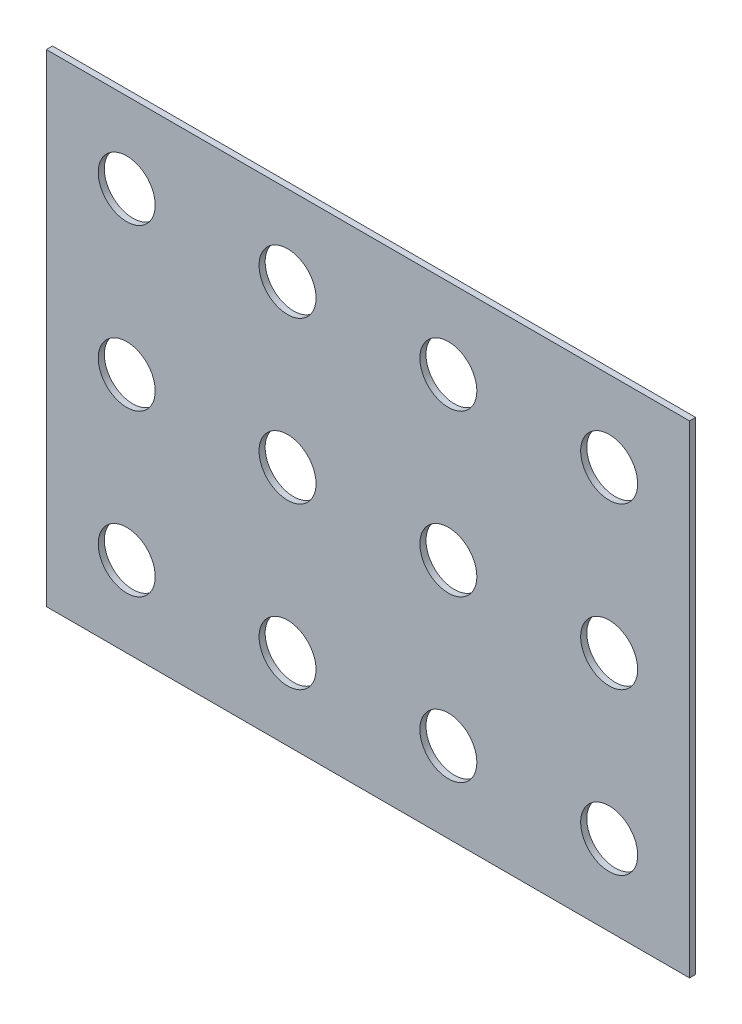
ISO-10303-21;
HEADER;
FILE_DESCRIPTION(('STEP AP214'),'2;1');
FILE_NAME('part.step','',(''),(''),'','','');
FILE_SCHEMA(('AUTOMOTIVE_DESIGN { 1 0 10303 214 1 1 1 1 }'));
ENDSEC;
DATA;
#1=APPLICATION_CONTEXT('core data for automotive mechanical design processes');
#2=APPLICATION_PROTOCOL_DEFINITION('international standard','automotive_design',2000,#1);
#3=PRODUCT_CONTEXT('',#1,'mechanical');
#4=PRODUCT('Part','Part','',(#3));
#5=PRODUCT_RELATED_PRODUCT_CATEGORY('part','',(#4));
#6=PRODUCT_DEFINITION_FORMATION('','',#4);
#7=PRODUCT_DEFINITION_CONTEXT('part definition',#1,'design');
#8=PRODUCT_DEFINITION('design','',#6,#7);
#9=PRODUCT_DEFINITION_SHAPE('','',#8);
#10=(LENGTH_UNIT() NAMED_UNIT(*) SI_UNIT(.MILLI.,.METRE.));
#11=(NAMED_UNIT(*) PLANE_ANGLE_UNIT() SI_UNIT($,.RADIAN.));
#12=(NAMED_UNIT(*) SI_UNIT($,.STERADIAN.) SOLID_ANGLE_UNIT());
#13=UNCERTAINTY_MEASURE_WITH_UNIT(LENGTH_MEASURE(1.E-05),#10,'distance_accuracy_value','');
#14=(GEOMETRIC_REPRESENTATION_CONTEXT(3) GLOBAL_UNCERTAINTY_ASSIGNED_CONTEXT((#13)) GLOBAL_UNIT_ASSIGNED_CONTEXT((#10,
#11,#12)) REPRESENTATION_CONTEXT('',''));
#15=CARTESIAN_POINT('',(0.,0.,0.));
#16=DIRECTION('',(0.,0.,1.));
#17=DIRECTION('',(1.,0.,0.));
#18=AXIS2_PLACEMENT_3D('',#15,#16,#17);
#19=CARTESIAN_POINT('',(0.,0.,0.09652));
#20=DIRECTION('',(0.,0.,1.));
#21=DIRECTION('',(1.,0.,0.));
#22=AXIS2_PLACEMENT_3D('',#19,#20,#21);
#23=PLANE('',#22);
#24=CARTESIAN_POINT('',(8.89,6.35,0.09652));
#25=DIRECTION('',(0.,0.,1.));
#26=DIRECTION('',(1.,0.,0.));
#27=AXIS2_PLACEMENT_3D('',#24,#25,#26);
#28=CIRCLE('',#27,0.4499991);
#29=CARTESIAN_POINT('',(9.3399991,6.35,0.09652));
#30=VERTEX_POINT('',#29);
#31=EDGE_CURVE('E27',#30,#30,#28,.T.);
#32=ORIENTED_EDGE('',*,*,#31,.F.);
#33=EDGE_LOOP('',(#32));
#34=FACE_BOUND('',#33,.T.);
#35=CARTESIAN_POINT('',(8.89,3.81,0.09652));
#36=DIRECTION('',(0.,0.,1.));
#37=DIRECTION('',(1.,0.,0.));
#38=AXIS2_PLACEMENT_3D('',#35,#36,#37);
#39=CIRCLE('',#38,0.4499991);
#40=CARTESIAN_POINT('',(9.3399991,3.81,0.09652));
#41=VERTEX_POINT('',#40);
#42=EDGE_CURVE('E238',#41,#41,#39,.T.);
#43=ORIENTED_EDGE('',*,*,#42,.F.);
#44=EDGE_LOOP('',(#43));
#45=FACE_BOUND('',#44,.T.);
#46=CARTESIAN_POINT('',(6.35,6.35,0.09652));
#47=DIRECTION('',(0.,0.,1.));
#48=DIRECTION('',(1.,0.,0.));
#49=AXIS2_PLACEMENT_3D('',#46,#47,#48);
#50=CIRCLE('',#49,0.4499991);
#51=CARTESIAN_POINT('',(6.7999991,6.35,0.09652));
#52=VERTEX_POINT('',#51);
#53=EDGE_CURVE('E102',#52,#52,#50,.T.);
#54=ORIENTED_EDGE('',*,*,#53,.F.);
#55=EDGE_LOOP('',(#54));
#56=FACE_BOUND('',#55,.T.);
#57=CARTESIAN_POINT('',(6.35,1.27,0.09652));
#58=DIRECTION('',(0.,0.,1.));
#59=DIRECTION('',(1.,0.,0.));
#60=AXIS2_PLACEMENT_3D('',#57,#58,#59);
#61=CIRCLE('',#60,0.4499991);
#62=CARTESIAN_POINT('',(6.7999991,1.27,0.09652));
#63=VERTEX_POINT('',#62);
#64=EDGE_CURVE('E230',#63,#63,#61,.T.);
#65=ORIENTED_EDGE('',*,*,#64,.F.);
#66=EDGE_LOOP('',(#65));
#67=FACE_BOUND('',#66,.T.);
#68=CARTESIAN_POINT('',(8.89,1.27,0.09652));
#69=DIRECTION('',(0.,0.,1.));
#70=DIRECTION('',(1.,0.,0.));
#71=AXIS2_PLACEMENT_3D('',#68,#69,#70);
#72=CIRCLE('',#71,0.4499991);
#73=CARTESIAN_POINT('',(9.3399991,1.27,0.09652));
#74=VERTEX_POINT('',#73);
#75=EDGE_CURVE('E332',#74,#74,#72,.T.);
#76=ORIENTED_EDGE('',*,*,#75,.F.);
#77=EDGE_LOOP('',(#76));
#78=FACE_BOUND('',#77,.T.);
#79=CARTESIAN_POINT('',(6.35,3.81,0.09652));
#80=DIRECTION('',(0.,0.,1.));
#81=DIRECTION('',(1.,0.,0.));
#82=AXIS2_PLACEMENT_3D('',#79,#80,#81);
#83=CIRCLE('',#82,0.4499991);
#84=CARTESIAN_POINT('',(6.7999991,3.81,0.09652));
#85=VERTEX_POINT('',#84);
#86=EDGE_CURVE('E260',#85,#85,#83,.T.);
#87=ORIENTED_EDGE('',*,*,#86,.F.);
#88=EDGE_LOOP('',(#87));
#89=FACE_BOUND('',#88,.T.);
#90=CARTESIAN_POINT('',(3.81,6.35,0.09652));
#91=DIRECTION('',(0.,0.,1.));
#92=DIRECTION('',(1.,0.,0.));
#93=AXIS2_PLACEMENT_3D('',#90,#91,#92);
#94=CIRCLE('',#93,0.4499991);
#95=CARTESIAN_POINT('',(4.2599991,6.35,0.09652));
#96=VERTEX_POINT('',#95);
#97=EDGE_CURVE('E225',#96,#96,#94,.T.);
#98=ORIENTED_EDGE('',*,*,#97,.F.);
#99=EDGE_LOOP('',(#98));
#100=FACE_BOUND('',#99,.T.);
#101=CARTESIAN_POINT('',(3.81,3.81,0.09652));
#102=DIRECTION('',(0.,0.,1.));
#103=DIRECTION('',(1.,0.,0.));
#104=AXIS2_PLACEMENT_3D('',#101,#102,#103);
#105=CIRCLE('',#104,0.4499991);
#106=CARTESIAN_POINT('',(4.2599991,3.81,0.09652));
#107=VERTEX_POINT('',#106);
#108=EDGE_CURVE('E216',#107,#107,#105,.T.);
#109=ORIENTED_EDGE('',*,*,#108,.F.);
#110=EDGE_LOOP('',(#109));
#111=FACE_BOUND('',#110,.T.);
#112=CARTESIAN_POINT('',(1.27,6.35,0.09652));
#113=DIRECTION('',(0.,0.,1.));
#114=DIRECTION('',(1.,0.,0.));
#115=AXIS2_PLACEMENT_3D('',#112,#113,#114);
#116=CIRCLE('',#115,0.4499991);
#117=CARTESIAN_POINT('',(1.7199991,6.35,0.09652));
#118=VERTEX_POINT('',#117);
#119=EDGE_CURVE('E273',#118,#118,#116,.T.);
#120=ORIENTED_EDGE('',*,*,#119,.F.);
#121=EDGE_LOOP('',(#120));
#122=FACE_BOUND('',#121,.T.);
#123=CARTESIAN_POINT('',(1.27,1.27,0.09652));
#124=DIRECTION('',(0.,0.,1.));
#125=DIRECTION('',(1.,0.,0.));
#126=AXIS2_PLACEMENT_3D('',#123,#124,#125);
#127=CIRCLE('',#126,0.4499991);
#128=CARTESIAN_POINT('',(1.7199991,1.27,0.09652));
#129=VERTEX_POINT('',#128);
#130=EDGE_CURVE('E291',#129,#129,#127,.T.);
#131=ORIENTED_EDGE('',*,*,#130,.F.);
#132=EDGE_LOOP('',(#131));
#133=FACE_BOUND('',#132,.T.);
#134=CARTESIAN_POINT('',(3.81,1.27,0.09652));
#135=DIRECTION('',(0.,0.,1.));
#136=DIRECTION('',(1.,0.,0.));
#137=AXIS2_PLACEMENT_3D('',#134,#135,#136);
#138=CIRCLE('',#137,0.4499991);
#139=CARTESIAN_POINT('',(4.2599991,1.27,0.09652));
#140=VERTEX_POINT('',#139);
#141=EDGE_CURVE('E217',#140,#140,#138,.T.);
#142=ORIENTED_EDGE('',*,*,#141,.F.);
#143=EDGE_LOOP('',(#142));
#144=FACE_BOUND('',#143,.T.);
#145=CARTESIAN_POINT('',(1.27,3.81,0.09652));
#146=DIRECTION('',(0.,0.,1.));
#147=DIRECTION('',(1.,0.,0.));
#148=AXIS2_PLACEMENT_3D('',#145,#146,#147);
#149=CIRCLE('',#148,0.4499991);
#150=CARTESIAN_POINT('',(1.7199991,3.81,0.09652));
#151=VERTEX_POINT('',#150);
#152=EDGE_CURVE('E233',#151,#151,#149,.T.);
#153=ORIENTED_EDGE('',*,*,#152,.F.);
#154=EDGE_LOOP('',(#153));
#155=FACE_BOUND('',#154,.T.);
#156=DIRECTION('',(-1.,0.,0.));
#157=VECTOR('',#156,1.);
#158=CARTESIAN_POINT('',(10.159999847412,0.,0.09652));
#159=LINE('',#158,#157);
#160=CARTESIAN_POINT('',(10.159999847412,0.,0.09652));
#161=VERTEX_POINT('',#160);
#162=CARTESIAN_POINT('',(0.,0.,0.09652));
#163=VERTEX_POINT('',#162);
#164=EDGE_CURVE('E176',#161,#163,#159,.T.);
#165=ORIENTED_EDGE('',*,*,#164,.F.);
#166=DIRECTION('',(0.,-1.,0.));
#167=VECTOR('',#166,1.);
#168=CARTESIAN_POINT('',(10.159999847412,7.619999885559,0.09652));
#169=LINE('',#168,#167);
#170=CARTESIAN_POINT('',(10.159999847412,7.619999885559,0.09652));
#171=VERTEX_POINT('',#170);
#172=EDGE_CURVE('E209',#171,#161,#169,.T.);
#173=ORIENTED_EDGE('',*,*,#172,.F.);
#174=DIRECTION('',(1.,0.,0.));
#175=VECTOR('',#174,1.);
#176=CARTESIAN_POINT('',(0.,7.619999885559,0.09652));
#177=LINE('',#176,#175);
#178=CARTESIAN_POINT('',(0.,7.619999885559,0.09652));
#179=VERTEX_POINT('',#178);
#180=EDGE_CURVE('E191',#179,#171,#177,.T.);
#181=ORIENTED_EDGE('',*,*,#180,.F.);
#182=DIRECTION('',(0.,1.,0.));
#183=VECTOR('',#182,1.);
#184=CARTESIAN_POINT('',(0.,0.,0.09652));
#185=LINE('',#184,#183);
#186=EDGE_CURVE('E189',#163,#179,#185,.T.);
#187=ORIENTED_EDGE('',*,*,#186,.F.);
#188=EDGE_LOOP('',(#165,#173,#181,#187));
#189=FACE_BOUND('',#188,.T.);
#190=ADVANCED_FACE('F16',(#34,#45,#56,#67,#78,#89,#100,#111,#122,#133,#144,#155,#189),#23,.T.);
#191=CARTESIAN_POINT('',(0.,0.,0.));
#192=DIRECTION('',(0.,0.,1.));
#193=DIRECTION('',(1.,0.,0.));
#194=AXIS2_PLACEMENT_3D('',#191,#192,#193);
#195=PLANE('',#194);
#196=CARTESIAN_POINT('',(8.89,6.35,0.));
#197=DIRECTION('',(0.,0.,1.));
#198=DIRECTION('',(1.,0.,0.));
#199=AXIS2_PLACEMENT_3D('',#196,#197,#198);
#200=CIRCLE('',#199,0.4499991);
#201=CARTESIAN_POINT('',(9.3399991,6.35,0.));
#202=VERTEX_POINT('',#201);
#203=EDGE_CURVE('E11',#202,#202,#200,.T.);
#204=ORIENTED_EDGE('',*,*,#203,.T.);
#205=EDGE_LOOP('',(#204));
#206=FACE_BOUND('',#205,.T.);
#207=CARTESIAN_POINT('',(8.89,3.81,0.));
#208=DIRECTION('',(0.,0.,1.));
#209=DIRECTION('',(1.,0.,0.));
#210=AXIS2_PLACEMENT_3D('',#207,#208,#209);
#211=CIRCLE('',#210,0.4499991);
#212=CARTESIAN_POINT('',(9.3399991,3.81,0.));
#213=VERTEX_POINT('',#212);
#214=EDGE_CURVE('E241',#213,#213,#211,.T.);
#215=ORIENTED_EDGE('',*,*,#214,.T.);
#216=EDGE_LOOP('',(#215));
#217=FACE_BOUND('',#216,.T.);
#218=CARTESIAN_POINT('',(6.35,6.35,0.));
#219=DIRECTION('',(0.,0.,1.));
#220=DIRECTION('',(1.,0.,0.));
#221=AXIS2_PLACEMENT_3D('',#218,#219,#220);
#222=CIRCLE('',#221,0.4499991);
#223=CARTESIAN_POINT('',(6.7999991,6.35,0.));
#224=VERTEX_POINT('',#223);
#225=EDGE_CURVE('E91',#224,#224,#222,.T.);
#226=ORIENTED_EDGE('',*,*,#225,.T.);
#227=EDGE_LOOP('',(#226));
#228=FACE_BOUND('',#227,.T.);
#229=CARTESIAN_POINT('',(6.35,1.27,0.));
#230=DIRECTION('',(0.,0.,1.));
#231=DIRECTION('',(1.,0.,0.));
#232=AXIS2_PLACEMENT_3D('',#229,#230,#231);
#233=CIRCLE('',#232,0.4499991);
#234=CARTESIAN_POINT('',(6.7999991,1.27,0.));
#235=VERTEX_POINT('',#234);
#236=EDGE_CURVE('E226',#235,#235,#233,.T.);
#237=ORIENTED_EDGE('',*,*,#236,.T.);
#238=EDGE_LOOP('',(#237));
#239=FACE_BOUND('',#238,.T.);
#240=CARTESIAN_POINT('',(8.89,1.27,0.));
#241=DIRECTION('',(0.,0.,1.));
#242=DIRECTION('',(1.,0.,0.));
#243=AXIS2_PLACEMENT_3D('',#240,#241,#242);
#244=CIRCLE('',#243,0.4499991);
#245=CARTESIAN_POINT('',(9.3399991,1.27,0.));
#246=VERTEX_POINT('',#245);
#247=EDGE_CURVE('E267',#246,#246,#244,.T.);
#248=ORIENTED_EDGE('',*,*,#247,.T.);
#249=EDGE_LOOP('',(#248));
#250=FACE_BOUND('',#249,.T.);
#251=CARTESIAN_POINT('',(6.35,3.81,0.));
#252=DIRECTION('',(0.,0.,1.));
#253=DIRECTION('',(1.,0.,0.));
#254=AXIS2_PLACEMENT_3D('',#251,#252,#253);
#255=CIRCLE('',#254,0.4499991);
#256=CARTESIAN_POINT('',(6.7999991,3.81,0.));
#257=VERTEX_POINT('',#256);
#258=EDGE_CURVE('E256',#257,#257,#255,.T.);
#259=ORIENTED_EDGE('',*,*,#258,.T.);
#260=EDGE_LOOP('',(#259));
#261=FACE_BOUND('',#260,.T.);
#262=CARTESIAN_POINT('',(3.81,6.35,0.));
#263=DIRECTION('',(0.,0.,1.));
#264=DIRECTION('',(1.,0.,0.));
#265=AXIS2_PLACEMENT_3D('',#262,#263,#264);
#266=CIRCLE('',#265,0.4499991);
#267=CARTESIAN_POINT('',(4.2599991,6.35,0.));
#268=VERTEX_POINT('',#267);
#269=EDGE_CURVE('E255',#268,#268,#266,.T.);
#270=ORIENTED_EDGE('',*,*,#269,.T.);
#271=EDGE_LOOP('',(#270));
#272=FACE_BOUND('',#271,.T.);
#273=CARTESIAN_POINT('',(3.81,3.81,0.));
#274=DIRECTION('',(0.,0.,1.));
#275=DIRECTION('',(1.,0.,0.));
#276=AXIS2_PLACEMENT_3D('',#273,#274,#275);
#277=CIRCLE('',#276,0.4499991);
#278=CARTESIAN_POINT('',(4.2599991,3.81,0.));
#279=VERTEX_POINT('',#278);
#280=EDGE_CURVE('E212',#279,#279,#277,.T.);
#281=ORIENTED_EDGE('',*,*,#280,.T.);
#282=EDGE_LOOP('',(#281));
#283=FACE_BOUND('',#282,.T.);
#284=CARTESIAN_POINT('',(1.27,6.35,0.));
#285=DIRECTION('',(0.,0.,1.));
#286=DIRECTION('',(1.,0.,0.));
#287=AXIS2_PLACEMENT_3D('',#284,#285,#286);
#288=CIRCLE('',#287,0.4499991);
#289=CARTESIAN_POINT('',(1.7199991,6.35,0.));
#290=VERTEX_POINT('',#289);
#291=EDGE_CURVE('E270',#290,#290,#288,.T.);
#292=ORIENTED_EDGE('',*,*,#291,.T.);
#293=EDGE_LOOP('',(#292));
#294=FACE_BOUND('',#293,.T.);
#295=CARTESIAN_POINT('',(1.27,1.27,0.));
#296=DIRECTION('',(0.,0.,1.));
#297=DIRECTION('',(1.,0.,0.));
#298=AXIS2_PLACEMENT_3D('',#295,#296,#297);
#299=CIRCLE('',#298,0.4499991);
#300=CARTESIAN_POINT('',(1.7199991,1.27,0.));
#301=VERTEX_POINT('',#300);
#302=EDGE_CURVE('E20',#301,#301,#299,.T.);
#303=ORIENTED_EDGE('',*,*,#302,.T.);
#304=EDGE_LOOP('',(#303));
#305=FACE_BOUND('',#304,.T.);
#306=CARTESIAN_POINT('',(3.81,1.27,0.));
#307=DIRECTION('',(0.,0.,1.));
#308=DIRECTION('',(1.,0.,0.));
#309=AXIS2_PLACEMENT_3D('',#306,#307,#308);
#310=CIRCLE('',#309,0.4499991);
#311=CARTESIAN_POINT('',(4.2599991,1.27,0.));
#312=VERTEX_POINT('',#311);
#313=EDGE_CURVE('E221',#312,#312,#310,.T.);
#314=ORIENTED_EDGE('',*,*,#313,.T.);
#315=EDGE_LOOP('',(#314));
#316=FACE_BOUND('',#315,.T.);
#317=CARTESIAN_POINT('',(1.27,3.81,0.));
#318=DIRECTION('',(0.,0.,1.));
#319=DIRECTION('',(1.,0.,0.));
#320=AXIS2_PLACEMENT_3D('',#317,#318,#319);
#321=CIRCLE('',#320,0.4499991);
#322=CARTESIAN_POINT('',(1.7199991,3.81,0.));
#323=VERTEX_POINT('',#322);
#324=EDGE_CURVE('E236',#323,#323,#321,.T.);
#325=ORIENTED_EDGE('',*,*,#324,.T.);
#326=EDGE_LOOP('',(#325));
#327=FACE_BOUND('',#326,.T.);
#328=DIRECTION('',(0.,1.,0.));
#329=VECTOR('',#328,1.);
#330=CARTESIAN_POINT('',(0.,0.,0.));
#331=LINE('',#330,#329);
#332=CARTESIAN_POINT('',(0.,0.,0.));
#333=VERTEX_POINT('',#332);
#334=CARTESIAN_POINT('',(0.,7.619999885559,0.));
#335=VERTEX_POINT('',#334);
#336=EDGE_CURVE('E199',#333,#335,#331,.T.);
#337=ORIENTED_EDGE('',*,*,#336,.T.);
#338=DIRECTION('',(1.,0.,0.));
#339=VECTOR('',#338,1.);
#340=CARTESIAN_POINT('',(0.,7.619999885559,0.));
#341=LINE('',#340,#339);
#342=CARTESIAN_POINT('',(10.159999847412,7.619999885559,0.));
#343=VERTEX_POINT('',#342);
#344=EDGE_CURVE('E211',#335,#343,#341,.T.);
#345=ORIENTED_EDGE('',*,*,#344,.T.);
#346=DIRECTION('',(0.,-1.,0.));
#347=VECTOR('',#346,1.);
#348=CARTESIAN_POINT('',(10.159999847412,7.619999885559,0.));
#349=LINE('',#348,#347);
#350=CARTESIAN_POINT('',(10.159999847412,0.,0.));
#351=VERTEX_POINT('',#350);
#352=EDGE_CURVE('E186',#343,#351,#349,.T.);
#353=ORIENTED_EDGE('',*,*,#352,.T.);
#354=DIRECTION('',(-1.,0.,0.));
#355=VECTOR('',#354,1.);
#356=CARTESIAN_POINT('',(10.159999847412,0.,0.));
#357=LINE('',#356,#355);
#358=EDGE_CURVE('E167',#351,#333,#357,.T.);
#359=ORIENTED_EDGE('',*,*,#358,.T.);
#360=EDGE_LOOP('',(#337,#345,#353,#359));
#361=FACE_BOUND('',#360,.T.);
#362=ADVANCED_FACE('F313',(#206,#217,#228,#239,#250,#261,#272,#283,#294,#305,#316,#327,#361),
#195,.F.);
#363=CARTESIAN_POINT('',(8.89,6.35,0.));
#364=DIRECTION('',(0.,0.,-1.));
#365=DIRECTION('',(1.,0.,0.));
#366=AXIS2_PLACEMENT_3D('',#363,#364,#365);
#367=CYLINDRICAL_SURFACE('',#366,0.4499991);
#368=DIRECTION('',(0.,0.,1.));
#369=VECTOR('',#368,1.);
#370=CARTESIAN_POINT('',(9.3399991,6.35,0.));
#371=LINE('',#370,#369);
#372=EDGE_CURVE('E243',#202,#30,#371,.T.);
#373=ORIENTED_EDGE('',*,*,#372,.T.);
#374=ORIENTED_EDGE('',*,*,#31,.T.);
#375=ORIENTED_EDGE('',*,*,#372,.F.);
#376=ORIENTED_EDGE('',*,*,#203,.F.);
#377=EDGE_LOOP('',(#373,#374,#375,#376));
#378=FACE_BOUND('',#377,.T.);
#379=ADVANCED_FACE('F393',(#378),#367,.F.);
#380=CARTESIAN_POINT('',(8.89,3.81,0.));
#381=DIRECTION('',(0.,0.,-1.));
#382=DIRECTION('',(1.,0.,0.));
#383=AXIS2_PLACEMENT_3D('',#380,#381,#382);
#384=CYLINDRICAL_SURFACE('',#383,0.4499991);
#385=DIRECTION('',(0.,0.,1.));
#386=VECTOR('',#385,1.);
#387=CARTESIAN_POINT('',(9.3399991,3.81,0.));
#388=LINE('',#387,#386);
#389=EDGE_CURVE('E242',#213,#41,#388,.T.);
#390=ORIENTED_EDGE('',*,*,#389,.T.);
#391=ORIENTED_EDGE('',*,*,#42,.T.);
#392=ORIENTED_EDGE('',*,*,#389,.F.);
#393=ORIENTED_EDGE('',*,*,#214,.F.);
#394=EDGE_LOOP('',(#390,#391,#392,#393));
#395=FACE_BOUND('',#394,.T.);
#396=ADVANCED_FACE('F399',(#395),#384,.F.);
#397=CARTESIAN_POINT('',(6.35,6.35,0.));
#398=DIRECTION('',(0.,0.,-1.));
#399=DIRECTION('',(1.,0.,0.));
#400=AXIS2_PLACEMENT_3D('',#397,#398,#399);
#401=CYLINDRICAL_SURFACE('',#400,0.4499991);
#402=DIRECTION('',(0.,0.,1.));
#403=VECTOR('',#402,1.);
#404=CARTESIAN_POINT('',(6.7999991,6.35,0.));
#405=LINE('',#404,#403);
#406=EDGE_CURVE('E229',#224,#52,#405,.T.);
#407=ORIENTED_EDGE('',*,*,#406,.T.);
#408=ORIENTED_EDGE('',*,*,#53,.T.);
#409=ORIENTED_EDGE('',*,*,#406,.F.);
#410=ORIENTED_EDGE('',*,*,#225,.F.);
#411=EDGE_LOOP('',(#407,#408,#409,#410));
#412=FACE_BOUND('',#411,.T.);
#413=ADVANCED_FACE('F18',(#412),#401,.F.);
#414=CARTESIAN_POINT('',(6.35,1.27,0.));
#415=DIRECTION('',(0.,0.,-1.));
#416=DIRECTION('',(1.,0.,0.));
#417=AXIS2_PLACEMENT_3D('',#414,#415,#416);
#418=CYLINDRICAL_SURFACE('',#417,0.4499991);
#419=DIRECTION('',(0.,0.,1.));
#420=VECTOR('',#419,1.);
#421=CARTESIAN_POINT('',(6.7999991,1.27,0.));
#422=LINE('',#421,#420);
#423=EDGE_CURVE('E263',#235,#63,#422,.T.);
#424=ORIENTED_EDGE('',*,*,#423,.T.);
#425=ORIENTED_EDGE('',*,*,#64,.T.);
#426=ORIENTED_EDGE('',*,*,#423,.F.);
#427=ORIENTED_EDGE('',*,*,#236,.F.);
#428=EDGE_LOOP('',(#424,#425,#426,#427));
#429=FACE_BOUND('',#428,.T.);
#430=ADVANCED_FACE('F416',(#429),#418,.F.);
#431=CARTESIAN_POINT('',(8.89,1.27,0.));
#432=DIRECTION('',(0.,0.,-1.));
#433=DIRECTION('',(1.,0.,0.));
#434=AXIS2_PLACEMENT_3D('',#431,#432,#433);
#435=CYLINDRICAL_SURFACE('',#434,0.4499991);
#436=DIRECTION('',(0.,0.,1.));
#437=VECTOR('',#436,1.);
#438=CARTESIAN_POINT('',(9.3399991,1.27,0.));
#439=LINE('',#438,#437);
#440=EDGE_CURVE('E259',#246,#74,#439,.T.);
#441=ORIENTED_EDGE('',*,*,#440,.T.);
#442=ORIENTED_EDGE('',*,*,#75,.T.);
#443=ORIENTED_EDGE('',*,*,#440,.F.);
#444=ORIENTED_EDGE('',*,*,#247,.F.);
#445=EDGE_LOOP('',(#441,#442,#443,#444));
#446=FACE_BOUND('',#445,.T.);
#447=ADVANCED_FACE('F364',(#446),#435,.F.);
#448=CARTESIAN_POINT('',(6.35,3.81,0.));
#449=DIRECTION('',(0.,0.,-1.));
#450=DIRECTION('',(1.,0.,0.));
#451=AXIS2_PLACEMENT_3D('',#448,#449,#450);
#452=CYLINDRICAL_SURFACE('',#451,0.4499991);
#453=DIRECTION('',(0.,0.,1.));
#454=VECTOR('',#453,1.);
#455=CARTESIAN_POINT('',(6.7999991,3.81,0.));
#456=LINE('',#455,#454);
#457=EDGE_CURVE('E280',#257,#85,#456,.T.);
#458=ORIENTED_EDGE('',*,*,#457,.T.);
#459=ORIENTED_EDGE('',*,*,#86,.T.);
#460=ORIENTED_EDGE('',*,*,#457,.F.);
#461=ORIENTED_EDGE('',*,*,#258,.F.);
#462=EDGE_LOOP('',(#458,#459,#460,#461));
#463=FACE_BOUND('',#462,.T.);
#464=ADVANCED_FACE('F428',(#463),#452,.F.);
#465=CARTESIAN_POINT('',(3.81,6.35,0.));
#466=DIRECTION('',(0.,0.,-1.));
#467=DIRECTION('',(1.,0.,0.));
#468=AXIS2_PLACEMENT_3D('',#465,#466,#467);
#469=CYLINDRICAL_SURFACE('',#468,0.4499991);
#470=DIRECTION('',(0.,0.,1.));
#471=VECTOR('',#470,1.);
#472=CARTESIAN_POINT('',(4.2599991,6.35,0.));
#473=LINE('',#472,#471);
#474=EDGE_CURVE('E215',#268,#96,#473,.T.);
#475=ORIENTED_EDGE('',*,*,#474,.T.);
#476=ORIENTED_EDGE('',*,*,#97,.T.);
#477=ORIENTED_EDGE('',*,*,#474,.F.);
#478=ORIENTED_EDGE('',*,*,#269,.F.);
#479=EDGE_LOOP('',(#475,#476,#477,#478));
#480=FACE_BOUND('',#479,.T.);
#481=ADVANCED_FACE('F414',(#480),#469,.F.);
#482=CARTESIAN_POINT('',(3.81,3.81,0.));
#483=DIRECTION('',(0.,0.,-1.));
#484=DIRECTION('',(1.,0.,0.));
#485=AXIS2_PLACEMENT_3D('',#482,#483,#484);
#486=CYLINDRICAL_SURFACE('',#485,0.4499991);
#487=DIRECTION('',(0.,0.,1.));
#488=VECTOR('',#487,1.);
#489=CARTESIAN_POINT('',(4.2599991,3.81,0.));
#490=LINE('',#489,#488);
#491=EDGE_CURVE('E272',#279,#107,#490,.T.);
#492=ORIENTED_EDGE('',*,*,#491,.T.);
#493=ORIENTED_EDGE('',*,*,#108,.T.);
#494=ORIENTED_EDGE('',*,*,#491,.F.);
#495=ORIENTED_EDGE('',*,*,#280,.F.);
#496=EDGE_LOOP('',(#492,#493,#494,#495));
#497=FACE_BOUND('',#496,.T.);
#498=ADVANCED_FACE('F410',(#497),#486,.F.);
#499=CARTESIAN_POINT('',(1.27,6.35,0.));
#500=DIRECTION('',(0.,0.,-1.));
#501=DIRECTION('',(1.,0.,0.));
#502=AXIS2_PLACEMENT_3D('',#499,#500,#501);
#503=CYLINDRICAL_SURFACE('',#502,0.4499991);
#504=DIRECTION('',(0.,0.,1.));
#505=VECTOR('',#504,1.);
#506=CARTESIAN_POINT('',(1.7199991,6.35,0.));
#507=LINE('',#506,#505);
#508=EDGE_CURVE('E299',#290,#118,#507,.T.);
#509=ORIENTED_EDGE('',*,*,#508,.T.);
#510=ORIENTED_EDGE('',*,*,#119,.T.);
#511=ORIENTED_EDGE('',*,*,#508,.F.);
#512=ORIENTED_EDGE('',*,*,#291,.F.);
#513=EDGE_LOOP('',(#509,#510,#511,#512));
#514=FACE_BOUND('',#513,.T.);
#515=ADVANCED_FACE('F413',(#514),#503,.F.);
#516=CARTESIAN_POINT('',(1.27,1.27,0.));
#517=DIRECTION('',(0.,0.,-1.));
#518=DIRECTION('',(1.,0.,0.));
#519=AXIS2_PLACEMENT_3D('',#516,#517,#518);
#520=CYLINDRICAL_SURFACE('',#519,0.4499991);
#521=DIRECTION('',(0.,0.,1.));
#522=VECTOR('',#521,1.);
#523=CARTESIAN_POINT('',(1.7199991,1.27,0.));
#524=LINE('',#523,#522);
#525=EDGE_CURVE('E294',#301,#129,#524,.T.);
#526=ORIENTED_EDGE('',*,*,#525,.T.);
#527=ORIENTED_EDGE('',*,*,#130,.T.);
#528=ORIENTED_EDGE('',*,*,#525,.F.);
#529=ORIENTED_EDGE('',*,*,#302,.F.);
#530=EDGE_LOOP('',(#526,#527,#528,#529));
#531=FACE_BOUND('',#530,.T.);
#532=ADVANCED_FACE('F318',(#531),#520,.F.);
#533=CARTESIAN_POINT('',(3.81,1.27,0.));
#534=DIRECTION('',(0.,0.,-1.));
#535=DIRECTION('',(1.,0.,0.));
#536=AXIS2_PLACEMENT_3D('',#533,#534,#535);
#537=CYLINDRICAL_SURFACE('',#536,0.4499991);
#538=DIRECTION('',(0.,0.,1.));
#539=VECTOR('',#538,1.);
#540=CARTESIAN_POINT('',(4.2599991,1.27,0.));
#541=LINE('',#540,#539);
#542=EDGE_CURVE('E207',#312,#140,#541,.T.);
#543=ORIENTED_EDGE('',*,*,#542,.T.);
#544=ORIENTED_EDGE('',*,*,#141,.T.);
#545=ORIENTED_EDGE('',*,*,#542,.F.);
#546=ORIENTED_EDGE('',*,*,#313,.F.);
#547=EDGE_LOOP('',(#543,#544,#545,#546));
#548=FACE_BOUND('',#547,.T.);
#549=ADVANCED_FACE('F422',(#548),#537,.F.);
#550=CARTESIAN_POINT('',(1.27,3.81,0.));
#551=DIRECTION('',(0.,0.,-1.));
#552=DIRECTION('',(1.,0.,0.));
#553=AXIS2_PLACEMENT_3D('',#550,#551,#552);
#554=CYLINDRICAL_SURFACE('',#553,0.4499991);
#555=DIRECTION('',(0.,0.,1.));
#556=VECTOR('',#555,1.);
#557=CARTESIAN_POINT('',(1.7199991,3.81,0.));
#558=LINE('',#557,#556);
#559=EDGE_CURVE('E237',#323,#151,#558,.T.);
#560=ORIENTED_EDGE('',*,*,#559,.T.);
#561=ORIENTED_EDGE('',*,*,#152,.T.);
#562=ORIENTED_EDGE('',*,*,#559,.F.);
#563=ORIENTED_EDGE('',*,*,#324,.F.);
#564=EDGE_LOOP('',(#560,#561,#562,#563));
#565=FACE_BOUND('',#564,.T.);
#566=ADVANCED_FACE('F387',(#565),#554,.F.);
#567=CARTESIAN_POINT('',(10.159999847412,0.,0.));
#568=DIRECTION('',(0.,-1.,0.));
#569=DIRECTION('',(0.,0.,-1.));
#570=AXIS2_PLACEMENT_3D('',#567,#568,#569);
#571=PLANE('',#570);
#572=DIRECTION('',(0.,0.,1.));
#573=VECTOR('',#572,1.);
#574=CARTESIAN_POINT('',(10.159999847412,0.,0.));
#575=LINE('',#574,#573);
#576=EDGE_CURVE('E182',#351,#161,#575,.T.);
#577=ORIENTED_EDGE('',*,*,#576,.T.);
#578=ORIENTED_EDGE('',*,*,#164,.T.);
#579=DIRECTION('',(0.,0.,1.));
#580=VECTOR('',#579,1.);
#581=CARTESIAN_POINT('',(0.,0.,0.));
#582=LINE('',#581,#580);
#583=EDGE_CURVE('E180',#333,#163,#582,.T.);
#584=ORIENTED_EDGE('',*,*,#583,.F.);
#585=ORIENTED_EDGE('',*,*,#358,.F.);
#586=EDGE_LOOP('',(#577,#578,#584,#585));
#587=FACE_BOUND('',#586,.T.);
#588=ADVANCED_FACE('F178',(#587),#571,.T.);
#589=CARTESIAN_POINT('',(10.159999847412,7.619999885559,0.));
#590=DIRECTION('',(1.,0.,0.));
#591=DIRECTION('',(0.,1.,0.));
#592=AXIS2_PLACEMENT_3D('',#589,#590,#591);
#593=PLANE('',#592);
#594=DIRECTION('',(0.,0.,1.));
#595=VECTOR('',#594,1.);
#596=CARTESIAN_POINT('',(10.159999847412,7.619999885559,0.));
#597=LINE('',#596,#595);
#598=EDGE_CURVE('E249',#343,#171,#597,.T.);
#599=ORIENTED_EDGE('',*,*,#598,.T.);
#600=ORIENTED_EDGE('',*,*,#172,.T.);
#601=ORIENTED_EDGE('',*,*,#576,.F.);
#602=ORIENTED_EDGE('',*,*,#352,.F.);
#603=EDGE_LOOP('',(#599,#600,#601,#602));
#604=FACE_BOUND('',#603,.T.);
#605=ADVANCED_FACE('F351',(#604),#593,.T.);
#606=CARTESIAN_POINT('',(0.,7.619999885559,0.));
#607=DIRECTION('',(0.,1.,0.));
#608=DIRECTION('',(1.,0.,0.));
#609=AXIS2_PLACEMENT_3D('',#606,#607,#608);
#610=PLANE('',#609);
#611=DIRECTION('',(0.,0.,1.));
#612=VECTOR('',#611,1.);
#613=CARTESIAN_POINT('',(0.,7.619999885559,0.));
#614=LINE('',#613,#612);
#615=EDGE_CURVE('E196',#335,#179,#614,.T.);
#616=ORIENTED_EDGE('',*,*,#615,.T.);
#617=ORIENTED_EDGE('',*,*,#180,.T.);
#618=ORIENTED_EDGE('',*,*,#598,.F.);
#619=ORIENTED_EDGE('',*,*,#344,.F.);
#620=EDGE_LOOP('',(#616,#617,#618,#619));
#621=FACE_BOUND('',#620,.T.);
#622=ADVANCED_FACE('F353',(#621),#610,.T.);
#623=CARTESIAN_POINT('',(0.,0.,0.));
#624=DIRECTION('',(-1.,0.,0.));
#625=DIRECTION('',(0.,0.,1.));
#626=AXIS2_PLACEMENT_3D('',#623,#624,#625);
#627=PLANE('',#626);
#628=ORIENTED_EDGE('',*,*,#583,.T.);
#629=ORIENTED_EDGE('',*,*,#186,.T.);
#630=ORIENTED_EDGE('',*,*,#615,.F.);
#631=ORIENTED_EDGE('',*,*,#336,.F.);
#632=EDGE_LOOP('',(#628,#629,#630,#631));
#633=FACE_BOUND('',#632,.T.);
#634=ADVANCED_FACE('F198',(#633),#627,.T.);
#635=CLOSED_SHELL('',(#190,#362,#379,#396,#413,#430,#447,#464,#481,#498,#515,#532,#549,#566,
#588,#605,#622,#634));
#636=MANIFOLD_SOLID_BREP('B1',#635);
#637=ADVANCED_BREP_SHAPE_REPRESENTATION('',(#18,#636),#14);
#638=SHAPE_DEFINITION_REPRESENTATION(#9,#637);
ENDSEC;
END-ISO-10303-21;
